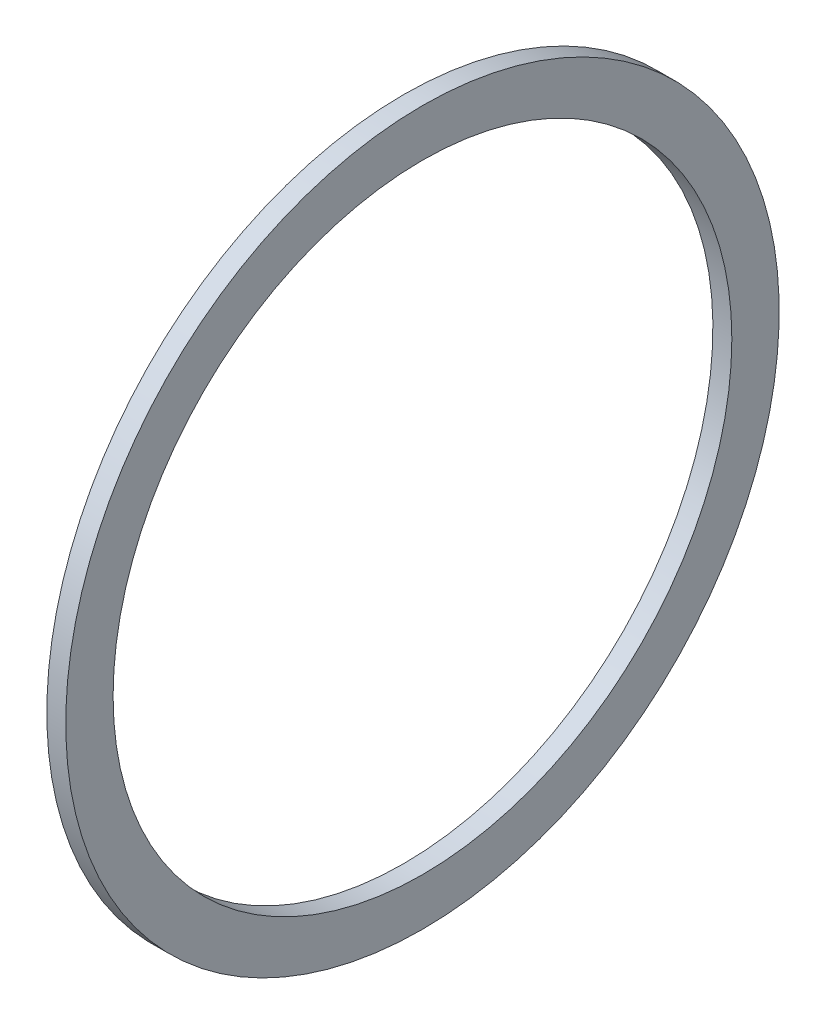
ISO-10303-21;
HEADER;
FILE_DESCRIPTION(('STEP AP214'),'2;1');
FILE_NAME('part.step','',(''),(''),'','','');
FILE_SCHEMA(('AUTOMOTIVE_DESIGN { 1 0 10303 214 1 1 1 1 }'));
ENDSEC;
DATA;
#1=APPLICATION_CONTEXT('core data for automotive mechanical design processes');
#2=APPLICATION_PROTOCOL_DEFINITION('international standard','automotive_design',2000,#1);
#3=PRODUCT_CONTEXT('',#1,'mechanical');
#4=PRODUCT('Part','Part','',(#3));
#5=PRODUCT_RELATED_PRODUCT_CATEGORY('part','',(#4));
#6=PRODUCT_DEFINITION_FORMATION('','',#4);
#7=PRODUCT_DEFINITION_CONTEXT('part definition',#1,'design');
#8=PRODUCT_DEFINITION('design','',#6,#7);
#9=PRODUCT_DEFINITION_SHAPE('','',#8);
#10=(LENGTH_UNIT() NAMED_UNIT(*) SI_UNIT(.MILLI.,.METRE.));
#11=(NAMED_UNIT(*) PLANE_ANGLE_UNIT() SI_UNIT($,.RADIAN.));
#12=(NAMED_UNIT(*) SI_UNIT($,.STERADIAN.) SOLID_ANGLE_UNIT());
#13=UNCERTAINTY_MEASURE_WITH_UNIT(LENGTH_MEASURE(1.E-05),#10,'distance_accuracy_value','');
#14=(GEOMETRIC_REPRESENTATION_CONTEXT(3) GLOBAL_UNCERTAINTY_ASSIGNED_CONTEXT((#13)) GLOBAL_UNIT_ASSIGNED_CONTEXT((#10,
#11,#12)) REPRESENTATION_CONTEXT('',''));
#15=CARTESIAN_POINT('',(0.,0.,0.));
#16=DIRECTION('',(0.,0.,1.));
#17=DIRECTION('',(1.,0.,0.));
#18=AXIS2_PLACEMENT_3D('',#15,#16,#17);
#19=CARTESIAN_POINT('',(-41.0533728527879,13.3,0.));
#20=DIRECTION('',(-1.,0.,0.));
#21=DIRECTION('',(0.,-1.,0.));
#22=AXIS2_PLACEMENT_3D('',#19,#20,#21);
#23=PLANE('',#22);
#24=CARTESIAN_POINT('',(-41.0533728527879,9.74999999999995,0.));
#25=DIRECTION('',(-1.,0.,0.));
#26=DIRECTION('',(0.,-1.,0.));
#27=AXIS2_PLACEMENT_3D('',#24,#25,#26);
#28=CIRCLE('',#27,49.);
#29=CARTESIAN_POINT('',(-41.0533728527879,-39.25,0.));
#30=VERTEX_POINT('',#29);
#31=EDGE_CURVE('E65',#30,#30,#28,.T.);
#32=ORIENTED_EDGE('',*,*,#31,.F.);
#33=EDGE_LOOP('',(#32));
#34=FACE_BOUND('',#33,.T.);
#35=CARTESIAN_POINT('',(-41.0533728527879,9.74999999999998,0.));
#36=DIRECTION('',(1.,0.,0.));
#37=DIRECTION('',(0.,1.,0.));
#38=AXIS2_PLACEMENT_3D('',#35,#36,#37);
#39=CIRCLE('',#38,56.5);
#40=CARTESIAN_POINT('',(-41.053372852788,66.25,0.));
#41=VERTEX_POINT('',#40);
#42=EDGE_CURVE('E59',#41,#41,#39,.T.);
#43=ORIENTED_EDGE('',*,*,#42,.F.);
#44=EDGE_LOOP('',(#43));
#45=FACE_BOUND('',#44,.T.);
#46=ADVANCED_FACE('F52',(#34,#45),#23,.T.);
#47=CARTESIAN_POINT('',(-38.0533728527879,13.3,0.));
#48=DIRECTION('',(1.,0.,0.));
#49=DIRECTION('',(0.,1.,0.));
#50=AXIS2_PLACEMENT_3D('',#47,#48,#49);
#51=PLANE('',#50);
#52=CARTESIAN_POINT('',(-38.0533728527879,9.74999999999995,0.));
#53=DIRECTION('',(1.,0.,0.));
#54=DIRECTION('',(0.,1.,0.));
#55=AXIS2_PLACEMENT_3D('',#52,#53,#54);
#56=CIRCLE('',#55,49.);
#57=CARTESIAN_POINT('',(-38.053372852788,58.75,0.));
#58=VERTEX_POINT('',#57);
#59=EDGE_CURVE('E69',#58,#58,#56,.F.);
#60=ORIENTED_EDGE('',*,*,#59,.T.);
#61=EDGE_LOOP('',(#60));
#62=FACE_BOUND('',#61,.T.);
#63=CARTESIAN_POINT('',(-38.0533728527879,9.74999999999998,0.));
#64=DIRECTION('',(1.,0.,0.));
#65=DIRECTION('',(0.,1.,0.));
#66=AXIS2_PLACEMENT_3D('',#63,#64,#65);
#67=CIRCLE('',#66,56.5);
#68=CARTESIAN_POINT('',(-38.053372852788,66.25,0.));
#69=VERTEX_POINT('',#68);
#70=EDGE_CURVE('E12',#69,#69,#67,.T.);
#71=ORIENTED_EDGE('',*,*,#70,.T.);
#72=EDGE_LOOP('',(#71));
#73=FACE_BOUND('',#72,.T.);
#74=ADVANCED_FACE('F76',(#62,#73),#51,.T.);
#75=CARTESIAN_POINT('',(-17.6629112004517,9.74999999999998,0.));
#76=DIRECTION('',(1.,0.,0.));
#77=DIRECTION('',(0.,1.,0.));
#78=AXIS2_PLACEMENT_3D('',#75,#76,#77);
#79=CYLINDRICAL_SURFACE('',#78,56.5);
#80=ORIENTED_EDGE('',*,*,#42,.T.);
#81=EDGE_LOOP('',(#80));
#82=FACE_BOUND('',#81,.T.);
#83=ORIENTED_EDGE('',*,*,#70,.F.);
#84=EDGE_LOOP('',(#83));
#85=FACE_BOUND('',#84,.T.);
#86=ADVANCED_FACE('F81',(#82,#85),#79,.T.);
#87=CARTESIAN_POINT('',(-38.0523728527879,9.74999999999995,0.));
#88=DIRECTION('',(-1.,0.,0.));
#89=DIRECTION('',(0.,-1.,0.));
#90=AXIS2_PLACEMENT_3D('',#87,#88,#89);
#91=CYLINDRICAL_SURFACE('',#90,49.);
#92=ORIENTED_EDGE('',*,*,#59,.F.);
#93=EDGE_LOOP('',(#92));
#94=FACE_BOUND('',#93,.T.);
#95=ORIENTED_EDGE('',*,*,#31,.T.);
#96=EDGE_LOOP('',(#95));
#97=FACE_BOUND('',#96,.T.);
#98=ADVANCED_FACE('F78',(#94,#97),#91,.F.);
#99=CLOSED_SHELL('',(#46,#74,#86,#98));
#100=MANIFOLD_SOLID_BREP('B2',#99);
#101=ADVANCED_BREP_SHAPE_REPRESENTATION('',(#18,#100),#14);
#102=SHAPE_DEFINITION_REPRESENTATION(#9,#101);
ENDSEC;
END-ISO-10303-21;
